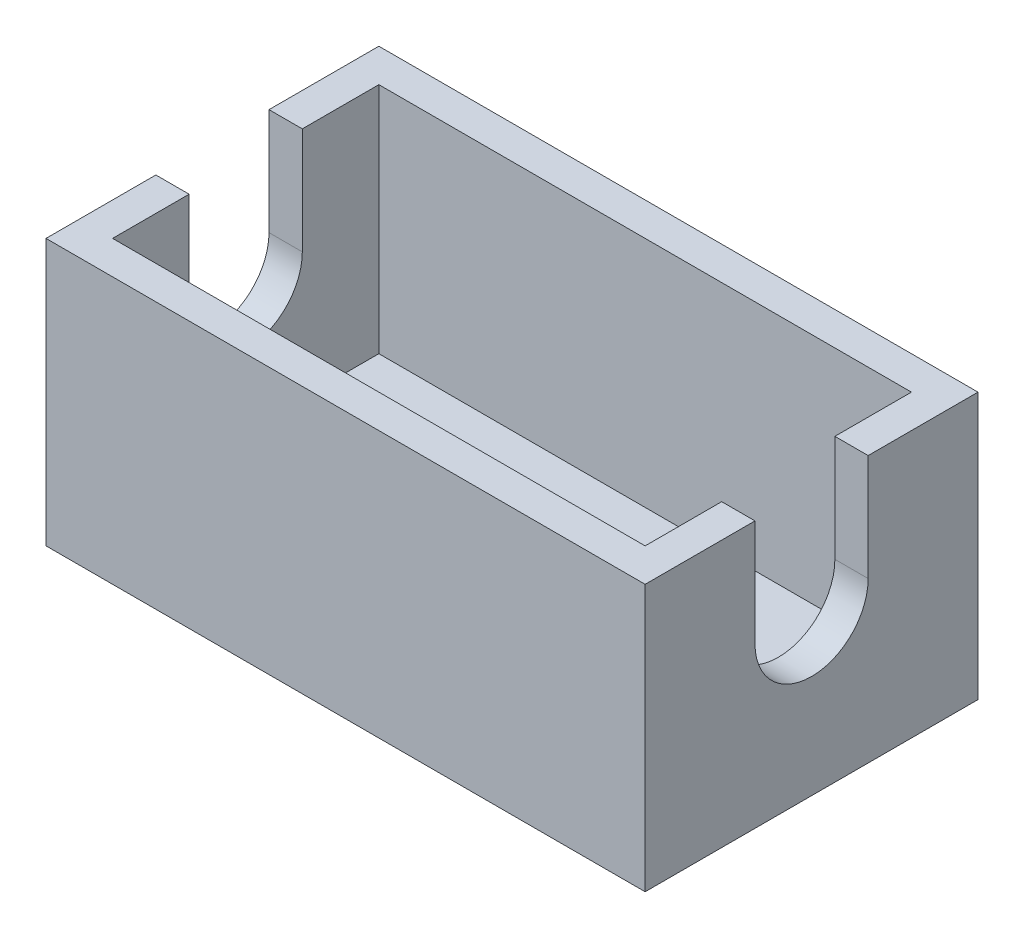
ISO-10303-21;
HEADER;
FILE_DESCRIPTION(('STEP AP214'),'2;1');
FILE_NAME('part.step','',(''),(''),'','','');
FILE_SCHEMA(('AUTOMOTIVE_DESIGN { 1 0 10303 214 1 1 1 1 }'));
ENDSEC;
DATA;
#1=APPLICATION_CONTEXT('core data for automotive mechanical design processes');
#2=APPLICATION_PROTOCOL_DEFINITION('international standard','automotive_design',2000,#1);
#3=PRODUCT_CONTEXT('',#1,'mechanical');
#4=PRODUCT('Part','Part','',(#3));
#5=PRODUCT_RELATED_PRODUCT_CATEGORY('part','',(#4));
#6=PRODUCT_DEFINITION_FORMATION('','',#4);
#7=PRODUCT_DEFINITION_CONTEXT('part definition',#1,'design');
#8=PRODUCT_DEFINITION('design','',#6,#7);
#9=PRODUCT_DEFINITION_SHAPE('','',#8);
#10=(LENGTH_UNIT() NAMED_UNIT(*) SI_UNIT(.MILLI.,.METRE.));
#11=(NAMED_UNIT(*) PLANE_ANGLE_UNIT() SI_UNIT($,.RADIAN.));
#12=(NAMED_UNIT(*) SI_UNIT($,.STERADIAN.) SOLID_ANGLE_UNIT());
#13=UNCERTAINTY_MEASURE_WITH_UNIT(LENGTH_MEASURE(1.E-05),#10,'distance_accuracy_value','');
#14=(GEOMETRIC_REPRESENTATION_CONTEXT(3) GLOBAL_UNCERTAINTY_ASSIGNED_CONTEXT((#13)) GLOBAL_UNIT_ASSIGNED_CONTEXT((#10,
#11,#12)) REPRESENTATION_CONTEXT('',''));
#15=CARTESIAN_POINT('',(0.,0.,0.));
#16=DIRECTION('',(0.,0.,1.));
#17=DIRECTION('',(1.,0.,0.));
#18=AXIS2_PLACEMENT_3D('',#15,#16,#17);
#19=CARTESIAN_POINT('',(0.,20.,0.));
#20=DIRECTION('',(0.,1.,0.));
#21=DIRECTION('',(0.,0.,1.));
#22=AXIS2_PLACEMENT_3D('',#19,#20,#21);
#23=PLANE('',#22);
#24=DIRECTION('',(1.,0.,0.));
#25=VECTOR('',#24,1.);
#26=CARTESIAN_POINT('',(-22.5,20.,4.25));
#27=LINE('',#26,#25);
#28=CARTESIAN_POINT('',(-22.5,20.,4.25));
#29=VERTEX_POINT('',#28);
#30=CARTESIAN_POINT('',(-20.,20.,4.25));
#31=VERTEX_POINT('',#30);
#32=EDGE_CURVE('E180',#29,#31,#27,.T.);
#33=ORIENTED_EDGE('',*,*,#32,.F.);
#34=DIRECTION('',(0.,0.,1.));
#35=VECTOR('',#34,1.);
#36=CARTESIAN_POINT('',(-22.5,20.,12.5));
#37=LINE('',#36,#35);
#38=CARTESIAN_POINT('',(-22.5,20.,12.5));
#39=VERTEX_POINT('',#38);
#40=EDGE_CURVE('E220',#29,#39,#37,.T.);
#41=ORIENTED_EDGE('',*,*,#40,.T.);
#42=DIRECTION('',(1.,0.,0.));
#43=VECTOR('',#42,1.);
#44=CARTESIAN_POINT('',(22.5,20.,12.5));
#45=LINE('',#44,#43);
#46=CARTESIAN_POINT('',(22.5,20.,12.5));
#47=VERTEX_POINT('',#46);
#48=EDGE_CURVE('E223',#39,#47,#45,.T.);
#49=ORIENTED_EDGE('',*,*,#48,.T.);
#50=DIRECTION('',(0.,0.,-1.));
#51=VECTOR('',#50,1.);
#52=CARTESIAN_POINT('',(22.5,20.,12.5));
#53=LINE('',#52,#51);
#54=CARTESIAN_POINT('',(22.5,20.,4.25));
#55=VERTEX_POINT('',#54);
#56=EDGE_CURVE('E227',#47,#55,#53,.T.);
#57=ORIENTED_EDGE('',*,*,#56,.T.);
#58=CARTESIAN_POINT('',(20.,20.,4.25));
#59=VERTEX_POINT('',#58);
#60=EDGE_CURVE('E182',#59,#55,#27,.T.);
#61=ORIENTED_EDGE('',*,*,#60,.F.);
#62=DIRECTION('',(0.,0.,-1.));
#63=VECTOR('',#62,1.);
#64=CARTESIAN_POINT('',(20.,20.,10.));
#65=LINE('',#64,#63);
#66=CARTESIAN_POINT('',(20.,20.,10.));
#67=VERTEX_POINT('',#66);
#68=EDGE_CURVE('E196',#67,#59,#65,.T.);
#69=ORIENTED_EDGE('',*,*,#68,.F.);
#70=DIRECTION('',(1.,0.,0.));
#71=VECTOR('',#70,1.);
#72=CARTESIAN_POINT('',(20.,20.,10.));
#73=LINE('',#72,#71);
#74=CARTESIAN_POINT('',(-20.,20.,10.));
#75=VERTEX_POINT('',#74);
#76=EDGE_CURVE('E192',#75,#67,#73,.T.);
#77=ORIENTED_EDGE('',*,*,#76,.F.);
#78=DIRECTION('',(0.,0.,1.));
#79=VECTOR('',#78,1.);
#80=CARTESIAN_POINT('',(-20.,20.,10.));
#81=LINE('',#80,#79);
#82=EDGE_CURVE('E193',#31,#75,#81,.T.);
#83=ORIENTED_EDGE('',*,*,#82,.F.);
#84=EDGE_LOOP('',(#33,#41,#49,#57,#61,#69,#77,#83));
#85=FACE_BOUND('',#84,.T.);
#86=ADVANCED_FACE('F33',(#85),#23,.T.);
#87=CARTESIAN_POINT('',(-22.5,2.5,12.5));
#88=DIRECTION('',(1.,0.,0.));
#89=DIRECTION('',(0.,0.,-1.));
#90=AXIS2_PLACEMENT_3D('',#87,#88,#89);
#91=PLANE('',#90);
#92=ORIENTED_EDGE('',*,*,#40,.F.);
#93=DIRECTION('',(0.,-1.,0.));
#94=VECTOR('',#93,1.);
#95=CARTESIAN_POINT('',(-22.5,12.,4.25));
#96=LINE('',#95,#94);
#97=CARTESIAN_POINT('',(-22.5,12.,4.25));
#98=VERTEX_POINT('',#97);
#99=EDGE_CURVE('E162',#29,#98,#96,.T.);
#100=ORIENTED_EDGE('',*,*,#99,.T.);
#101=CARTESIAN_POINT('',(-22.5,12.,0.));
#102=DIRECTION('',(1.,0.,0.));
#103=DIRECTION('',(0.,0.,-1.));
#104=AXIS2_PLACEMENT_3D('',#101,#102,#103);
#105=CIRCLE('',#104,4.25);
#106=CARTESIAN_POINT('',(-22.5,12.,-4.25));
#107=VERTEX_POINT('',#106);
#108=EDGE_CURVE('E147',#98,#107,#105,.T.);
#109=ORIENTED_EDGE('',*,*,#108,.T.);
#110=DIRECTION('',(0.,1.,0.));
#111=VECTOR('',#110,1.);
#112=CARTESIAN_POINT('',(-22.5,20.,-4.25));
#113=LINE('',#112,#111);
#114=CARTESIAN_POINT('',(-22.5,20.,-4.25));
#115=VERTEX_POINT('',#114);
#116=EDGE_CURVE('E155',#107,#115,#113,.T.);
#117=ORIENTED_EDGE('',*,*,#116,.T.);
#118=CARTESIAN_POINT('',(-22.5,20.,-12.5));
#119=VERTEX_POINT('',#118);
#120=EDGE_CURVE('E221',#119,#115,#37,.T.);
#121=ORIENTED_EDGE('',*,*,#120,.F.);
#122=DIRECTION('',(0.,-1.,0.));
#123=VECTOR('',#122,1.);
#124=CARTESIAN_POINT('',(-22.5,2.5,-12.5));
#125=LINE('',#124,#123);
#126=CARTESIAN_POINT('',(-22.5,0.,-12.5));
#127=VERTEX_POINT('',#126);
#128=EDGE_CURVE('E242',#119,#127,#125,.T.);
#129=ORIENTED_EDGE('',*,*,#128,.T.);
#130=DIRECTION('',(0.,0.,1.));
#131=VECTOR('',#130,1.);
#132=CARTESIAN_POINT('',(-22.5,0.,12.5));
#133=LINE('',#132,#131);
#134=CARTESIAN_POINT('',(-22.5,0.,12.5));
#135=VERTEX_POINT('',#134);
#136=EDGE_CURVE('E233',#127,#135,#133,.T.);
#137=ORIENTED_EDGE('',*,*,#136,.T.);
#138=DIRECTION('',(0.,-1.,0.));
#139=VECTOR('',#138,1.);
#140=CARTESIAN_POINT('',(-22.5,2.5,12.5));
#141=LINE('',#140,#139);
#142=EDGE_CURVE('E251',#39,#135,#141,.T.);
#143=ORIENTED_EDGE('',*,*,#142,.F.);
#144=EDGE_LOOP('',(#92,#100,#109,#117,#121,#129,#137,#143));
#145=FACE_BOUND('',#144,.T.);
#146=ADVANCED_FACE('F35',(#145),#91,.F.);
#147=CARTESIAN_POINT('',(22.5,2.5,12.5));
#148=DIRECTION('',(0.,0.,-1.));
#149=DIRECTION('',(-1.,0.,0.));
#150=AXIS2_PLACEMENT_3D('',#147,#148,#149);
#151=PLANE('',#150);
#152=DIRECTION('',(1.,0.,0.));
#153=VECTOR('',#152,1.);
#154=CARTESIAN_POINT('',(22.5,0.,12.5));
#155=LINE('',#154,#153);
#156=CARTESIAN_POINT('',(22.5,0.,12.5));
#157=VERTEX_POINT('',#156);
#158=EDGE_CURVE('E236',#135,#157,#155,.T.);
#159=ORIENTED_EDGE('',*,*,#158,.T.);
#160=DIRECTION('',(0.,-1.,0.));
#161=VECTOR('',#160,1.);
#162=CARTESIAN_POINT('',(22.5,2.5,12.5));
#163=LINE('',#162,#161);
#164=EDGE_CURVE('E248',#47,#157,#163,.T.);
#165=ORIENTED_EDGE('',*,*,#164,.F.);
#166=ORIENTED_EDGE('',*,*,#48,.F.);
#167=ORIENTED_EDGE('',*,*,#142,.T.);
#168=EDGE_LOOP('',(#159,#165,#166,#167));
#169=FACE_BOUND('',#168,.T.);
#170=ADVANCED_FACE('F315',(#169),#151,.F.);
#171=CARTESIAN_POINT('',(22.5,2.5,12.5));
#172=DIRECTION('',(-1.,0.,0.));
#173=DIRECTION('',(0.,0.,1.));
#174=AXIS2_PLACEMENT_3D('',#171,#172,#173);
#175=PLANE('',#174);
#176=CARTESIAN_POINT('',(22.5,12.,0.));
#177=DIRECTION('',(1.,0.,0.));
#178=DIRECTION('',(0.,0.,-1.));
#179=AXIS2_PLACEMENT_3D('',#176,#177,#178);
#180=CIRCLE('',#179,4.25);
#181=CARTESIAN_POINT('',(22.5,12.,4.25));
#182=VERTEX_POINT('',#181);
#183=CARTESIAN_POINT('',(22.5,12.,-4.25));
#184=VERTEX_POINT('',#183);
#185=EDGE_CURVE('E172',#182,#184,#180,.T.);
#186=ORIENTED_EDGE('',*,*,#185,.F.);
#187=DIRECTION('',(0.,-1.,0.));
#188=VECTOR('',#187,1.);
#189=CARTESIAN_POINT('',(22.5,12.,4.25));
#190=LINE('',#189,#188);
#191=EDGE_CURVE('E165',#55,#182,#190,.T.);
#192=ORIENTED_EDGE('',*,*,#191,.F.);
#193=ORIENTED_EDGE('',*,*,#56,.F.);
#194=ORIENTED_EDGE('',*,*,#164,.T.);
#195=DIRECTION('',(0.,0.,-1.));
#196=VECTOR('',#195,1.);
#197=CARTESIAN_POINT('',(22.5,0.,12.5));
#198=LINE('',#197,#196);
#199=CARTESIAN_POINT('',(22.5,0.,-12.5));
#200=VERTEX_POINT('',#199);
#201=EDGE_CURVE('E238',#157,#200,#198,.T.);
#202=ORIENTED_EDGE('',*,*,#201,.T.);
#203=DIRECTION('',(0.,-1.,0.));
#204=VECTOR('',#203,1.);
#205=CARTESIAN_POINT('',(22.5,2.5,-12.5));
#206=LINE('',#205,#204);
#207=CARTESIAN_POINT('',(22.5,20.,-12.5));
#208=VERTEX_POINT('',#207);
#209=EDGE_CURVE('E245',#208,#200,#206,.T.);
#210=ORIENTED_EDGE('',*,*,#209,.F.);
#211=CARTESIAN_POINT('',(22.5,20.,-4.25));
#212=VERTEX_POINT('',#211);
#213=EDGE_CURVE('E226',#212,#208,#53,.T.);
#214=ORIENTED_EDGE('',*,*,#213,.F.);
#215=DIRECTION('',(0.,1.,0.));
#216=VECTOR('',#215,1.);
#217=CARTESIAN_POINT('',(22.5,20.,-4.25));
#218=LINE('',#217,#216);
#219=EDGE_CURVE('E168',#184,#212,#218,.T.);
#220=ORIENTED_EDGE('',*,*,#219,.F.);
#221=EDGE_LOOP('',(#186,#192,#193,#194,#202,#210,#214,#220));
#222=FACE_BOUND('',#221,.T.);
#223=ADVANCED_FACE('F277',(#222),#175,.F.);
#224=CARTESIAN_POINT('',(22.5,2.5,-12.5));
#225=DIRECTION('',(0.,0.,1.));
#226=DIRECTION('',(1.,0.,0.));
#227=AXIS2_PLACEMENT_3D('',#224,#225,#226);
#228=PLANE('',#227);
#229=DIRECTION('',(-1.,0.,0.));
#230=VECTOR('',#229,1.);
#231=CARTESIAN_POINT('',(22.5,0.,-12.5));
#232=LINE('',#231,#230);
#233=EDGE_CURVE('E240',#200,#127,#232,.T.);
#234=ORIENTED_EDGE('',*,*,#233,.T.);
#235=ORIENTED_EDGE('',*,*,#128,.F.);
#236=DIRECTION('',(-1.,0.,0.));
#237=VECTOR('',#236,1.);
#238=CARTESIAN_POINT('',(22.5,20.,-12.5));
#239=LINE('',#238,#237);
#240=EDGE_CURVE('E230',#208,#119,#239,.T.);
#241=ORIENTED_EDGE('',*,*,#240,.F.);
#242=ORIENTED_EDGE('',*,*,#209,.T.);
#243=EDGE_LOOP('',(#234,#235,#241,#242));
#244=FACE_BOUND('',#243,.T.);
#245=ADVANCED_FACE('F322',(#244),#228,.F.);
#246=CARTESIAN_POINT('',(0.,0.,0.));
#247=DIRECTION('',(0.,1.,0.));
#248=DIRECTION('',(0.,0.,1.));
#249=AXIS2_PLACEMENT_3D('',#246,#247,#248);
#250=PLANE('',#249);
#251=ORIENTED_EDGE('',*,*,#136,.F.);
#252=ORIENTED_EDGE('',*,*,#233,.F.);
#253=ORIENTED_EDGE('',*,*,#201,.F.);
#254=ORIENTED_EDGE('',*,*,#158,.F.);
#255=EDGE_LOOP('',(#251,#252,#253,#254));
#256=FACE_BOUND('',#255,.T.);
#257=ADVANCED_FACE('F318',(#256),#250,.F.);
#258=DIRECTION('',(1.,0.,0.));
#259=VECTOR('',#258,1.);
#260=CARTESIAN_POINT('',(-22.5,20.,-4.25));
#261=LINE('',#260,#259);
#262=CARTESIAN_POINT('',(20.,20.,-4.25));
#263=VERTEX_POINT('',#262);
#264=EDGE_CURVE('E56',#263,#212,#261,.T.);
#265=ORIENTED_EDGE('',*,*,#264,.T.);
#266=ORIENTED_EDGE('',*,*,#213,.T.);
#267=ORIENTED_EDGE('',*,*,#240,.T.);
#268=ORIENTED_EDGE('',*,*,#120,.T.);
#269=CARTESIAN_POINT('',(-20.,20.,-4.25));
#270=VERTEX_POINT('',#269);
#271=EDGE_CURVE('E158',#115,#270,#261,.T.);
#272=ORIENTED_EDGE('',*,*,#271,.T.);
#273=CARTESIAN_POINT('',(-20.,20.,-10.));
#274=VERTEX_POINT('',#273);
#275=EDGE_CURVE('E189',#274,#270,#81,.T.);
#276=ORIENTED_EDGE('',*,*,#275,.F.);
#277=DIRECTION('',(-1.,0.,0.));
#278=VECTOR('',#277,1.);
#279=CARTESIAN_POINT('',(20.,20.,-10.));
#280=LINE('',#279,#278);
#281=CARTESIAN_POINT('',(20.,20.,-10.));
#282=VERTEX_POINT('',#281);
#283=EDGE_CURVE('E199',#282,#274,#280,.T.);
#284=ORIENTED_EDGE('',*,*,#283,.F.);
#285=EDGE_CURVE('E195',#263,#282,#65,.T.);
#286=ORIENTED_EDGE('',*,*,#285,.F.);
#287=EDGE_LOOP('',(#265,#266,#267,#268,#272,#276,#284,#286));
#288=FACE_BOUND('',#287,.T.);
#289=ADVANCED_FACE('F284',(#288),#23,.T.);
#290=CARTESIAN_POINT('',(-20.,20.,10.));
#291=DIRECTION('',(1.,0.,0.));
#292=DIRECTION('',(0.,0.,-1.));
#293=AXIS2_PLACEMENT_3D('',#290,#291,#292);
#294=PLANE('',#293);
#295=DIRECTION('',(0.,-1.,0.));
#296=VECTOR('',#295,1.);
#297=CARTESIAN_POINT('',(-20.,20.,4.25));
#298=LINE('',#297,#296);
#299=CARTESIAN_POINT('',(-20.,12.,4.25));
#300=VERTEX_POINT('',#299);
#301=EDGE_CURVE('E185',#31,#300,#298,.T.);
#302=ORIENTED_EDGE('',*,*,#301,.F.);
#303=ORIENTED_EDGE('',*,*,#82,.T.);
#304=DIRECTION('',(0.,-1.,0.));
#305=VECTOR('',#304,1.);
#306=CARTESIAN_POINT('',(-20.,20.,10.));
#307=LINE('',#306,#305);
#308=CARTESIAN_POINT('',(-20.,2.5,10.));
#309=VERTEX_POINT('',#308);
#310=EDGE_CURVE('E217',#75,#309,#307,.T.);
#311=ORIENTED_EDGE('',*,*,#310,.T.);
#312=DIRECTION('',(0.,0.,1.));
#313=VECTOR('',#312,1.);
#314=CARTESIAN_POINT('',(-20.,2.5,10.));
#315=LINE('',#314,#313);
#316=CARTESIAN_POINT('',(-20.,2.5,-10.));
#317=VERTEX_POINT('',#316);
#318=EDGE_CURVE('E188',#317,#309,#315,.T.);
#319=ORIENTED_EDGE('',*,*,#318,.F.);
#320=DIRECTION('',(0.,-1.,0.));
#321=VECTOR('',#320,1.);
#322=CARTESIAN_POINT('',(-20.,20.,-10.));
#323=LINE('',#322,#321);
#324=EDGE_CURVE('E201',#274,#317,#323,.T.);
#325=ORIENTED_EDGE('',*,*,#324,.F.);
#326=ORIENTED_EDGE('',*,*,#275,.T.);
#327=DIRECTION('',(0.,1.,0.));
#328=VECTOR('',#327,1.);
#329=CARTESIAN_POINT('',(-20.,20.,-4.25));
#330=LINE('',#329,#328);
#331=CARTESIAN_POINT('',(-20.,12.,-4.25));
#332=VERTEX_POINT('',#331);
#333=EDGE_CURVE('E178',#332,#270,#330,.T.);
#334=ORIENTED_EDGE('',*,*,#333,.F.);
#335=CARTESIAN_POINT('',(-20.,12.,0.));
#336=DIRECTION('',(1.,0.,0.));
#337=DIRECTION('',(0.,0.,-1.));
#338=AXIS2_PLACEMENT_3D('',#335,#336,#337);
#339=CIRCLE('',#338,4.25);
#340=EDGE_CURVE('E150',#300,#332,#339,.T.);
#341=ORIENTED_EDGE('',*,*,#340,.F.);
#342=EDGE_LOOP('',(#302,#303,#311,#319,#325,#326,#334,#341));
#343=FACE_BOUND('',#342,.T.);
#344=ADVANCED_FACE('F298',(#343),#294,.T.);
#345=CARTESIAN_POINT('',(20.,20.,10.));
#346=DIRECTION('',(0.,0.,-1.));
#347=DIRECTION('',(-1.,0.,0.));
#348=AXIS2_PLACEMENT_3D('',#345,#346,#347);
#349=PLANE('',#348);
#350=DIRECTION('',(1.,0.,0.));
#351=VECTOR('',#350,1.);
#352=CARTESIAN_POINT('',(20.,2.5,10.));
#353=LINE('',#352,#351);
#354=CARTESIAN_POINT('',(20.,2.5,10.));
#355=VERTEX_POINT('',#354);
#356=EDGE_CURVE('E203',#309,#355,#353,.T.);
#357=ORIENTED_EDGE('',*,*,#356,.F.);
#358=ORIENTED_EDGE('',*,*,#310,.F.);
#359=ORIENTED_EDGE('',*,*,#76,.T.);
#360=DIRECTION('',(0.,-1.,0.));
#361=VECTOR('',#360,1.);
#362=CARTESIAN_POINT('',(20.,20.,10.));
#363=LINE('',#362,#361);
#364=EDGE_CURVE('E214',#67,#355,#363,.T.);
#365=ORIENTED_EDGE('',*,*,#364,.T.);
#366=EDGE_LOOP('',(#357,#358,#359,#365));
#367=FACE_BOUND('',#366,.T.);
#368=ADVANCED_FACE('F301',(#367),#349,.T.);
#369=CARTESIAN_POINT('',(20.,20.,10.));
#370=DIRECTION('',(-1.,0.,0.));
#371=DIRECTION('',(0.,0.,1.));
#372=AXIS2_PLACEMENT_3D('',#369,#370,#371);
#373=PLANE('',#372);
#374=DIRECTION('',(0.,1.,0.));
#375=VECTOR('',#374,1.);
#376=CARTESIAN_POINT('',(20.,20.,4.25));
#377=LINE('',#376,#375);
#378=CARTESIAN_POINT('',(20.,12.,4.25));
#379=VERTEX_POINT('',#378);
#380=EDGE_CURVE('E11',#379,#59,#377,.T.);
#381=ORIENTED_EDGE('',*,*,#380,.F.);
#382=CARTESIAN_POINT('',(20.,12.,0.));
#383=DIRECTION('',(-1.,0.,0.));
#384=DIRECTION('',(0.,0.,1.));
#385=AXIS2_PLACEMENT_3D('',#382,#383,#384);
#386=CIRCLE('',#385,4.25);
#387=CARTESIAN_POINT('',(20.,12.,-4.25));
#388=VERTEX_POINT('',#387);
#389=EDGE_CURVE('E41',#388,#379,#386,.T.);
#390=ORIENTED_EDGE('',*,*,#389,.F.);
#391=DIRECTION('',(0.,-1.,0.));
#392=VECTOR('',#391,1.);
#393=CARTESIAN_POINT('',(20.,20.,-4.25));
#394=LINE('',#393,#392);
#395=EDGE_CURVE('E254',#263,#388,#394,.T.);
#396=ORIENTED_EDGE('',*,*,#395,.F.);
#397=ORIENTED_EDGE('',*,*,#285,.T.);
#398=DIRECTION('',(0.,-1.,0.));
#399=VECTOR('',#398,1.);
#400=CARTESIAN_POINT('',(20.,20.,-10.));
#401=LINE('',#400,#399);
#402=CARTESIAN_POINT('',(20.,2.5,-10.));
#403=VERTEX_POINT('',#402);
#404=EDGE_CURVE('E211',#282,#403,#401,.T.);
#405=ORIENTED_EDGE('',*,*,#404,.T.);
#406=DIRECTION('',(0.,0.,-1.));
#407=VECTOR('',#406,1.);
#408=CARTESIAN_POINT('',(20.,2.5,10.));
#409=LINE('',#408,#407);
#410=EDGE_CURVE('E205',#355,#403,#409,.T.);
#411=ORIENTED_EDGE('',*,*,#410,.F.);
#412=ORIENTED_EDGE('',*,*,#364,.F.);
#413=ORIENTED_EDGE('',*,*,#68,.T.);
#414=EDGE_LOOP('',(#381,#390,#396,#397,#405,#411,#412,#413));
#415=FACE_BOUND('',#414,.T.);
#416=ADVANCED_FACE('F267',(#415),#373,.T.);
#417=CARTESIAN_POINT('',(20.,20.,-10.));
#418=DIRECTION('',(0.,0.,1.));
#419=DIRECTION('',(1.,0.,0.));
#420=AXIS2_PLACEMENT_3D('',#417,#418,#419);
#421=PLANE('',#420);
#422=DIRECTION('',(-1.,0.,0.));
#423=VECTOR('',#422,1.);
#424=CARTESIAN_POINT('',(20.,2.5,-10.));
#425=LINE('',#424,#423);
#426=EDGE_CURVE('E207',#403,#317,#425,.T.);
#427=ORIENTED_EDGE('',*,*,#426,.F.);
#428=ORIENTED_EDGE('',*,*,#404,.F.);
#429=ORIENTED_EDGE('',*,*,#283,.T.);
#430=ORIENTED_EDGE('',*,*,#324,.T.);
#431=EDGE_LOOP('',(#427,#428,#429,#430));
#432=FACE_BOUND('',#431,.T.);
#433=ADVANCED_FACE('F290',(#432),#421,.T.);
#434=CARTESIAN_POINT('',(0.,2.5,0.));
#435=DIRECTION('',(0.,1.,0.));
#436=DIRECTION('',(0.,0.,1.));
#437=AXIS2_PLACEMENT_3D('',#434,#435,#436);
#438=PLANE('',#437);
#439=ORIENTED_EDGE('',*,*,#318,.T.);
#440=ORIENTED_EDGE('',*,*,#356,.T.);
#441=ORIENTED_EDGE('',*,*,#410,.T.);
#442=ORIENTED_EDGE('',*,*,#426,.T.);
#443=EDGE_LOOP('',(#439,#440,#441,#442));
#444=FACE_BOUND('',#443,.T.);
#445=ADVANCED_FACE('F294',(#444),#438,.T.);
#446=CARTESIAN_POINT('',(-22.5,12.,4.25));
#447=DIRECTION('',(0.,0.,1.));
#448=DIRECTION('',(1.,0.,0.));
#449=AXIS2_PLACEMENT_3D('',#446,#447,#448);
#450=PLANE('',#449);
#451=ORIENTED_EDGE('',*,*,#380,.T.);
#452=ORIENTED_EDGE('',*,*,#60,.T.);
#453=ORIENTED_EDGE('',*,*,#191,.T.);
#454=DIRECTION('',(1.,0.,0.));
#455=VECTOR('',#454,1.);
#456=CARTESIAN_POINT('',(-22.5,12.,4.25));
#457=LINE('',#456,#455);
#458=EDGE_CURVE('E179',#379,#182,#457,.T.);
#459=ORIENTED_EDGE('',*,*,#458,.F.);
#460=EDGE_LOOP('',(#451,#452,#453,#459));
#461=FACE_BOUND('',#460,.T.);
#462=ADVANCED_FACE('F263',(#461),#450,.F.);
#463=CARTESIAN_POINT('',(-22.5,20.,-4.25));
#464=DIRECTION('',(0.,0.,-1.));
#465=DIRECTION('',(0.,1.,0.));
#466=AXIS2_PLACEMENT_3D('',#463,#464,#465);
#467=PLANE('',#466);
#468=ORIENTED_EDGE('',*,*,#395,.T.);
#469=DIRECTION('',(1.,0.,0.));
#470=VECTOR('',#469,1.);
#471=CARTESIAN_POINT('',(-22.5,12.,-4.25));
#472=LINE('',#471,#470);
#473=EDGE_CURVE('E152',#388,#184,#472,.T.);
#474=ORIENTED_EDGE('',*,*,#473,.T.);
#475=ORIENTED_EDGE('',*,*,#219,.T.);
#476=ORIENTED_EDGE('',*,*,#264,.F.);
#477=EDGE_LOOP('',(#468,#474,#475,#476));
#478=FACE_BOUND('',#477,.T.);
#479=ADVANCED_FACE('F281',(#478),#467,.F.);
#480=CARTESIAN_POINT('',(-22.5,12.,0.));
#481=DIRECTION('',(1.,0.,0.));
#482=DIRECTION('',(0.,0.,-1.));
#483=AXIS2_PLACEMENT_3D('',#480,#481,#482);
#484=CYLINDRICAL_SURFACE('',#483,4.25);
#485=ORIENTED_EDGE('',*,*,#389,.T.);
#486=ORIENTED_EDGE('',*,*,#458,.T.);
#487=ORIENTED_EDGE('',*,*,#185,.T.);
#488=ORIENTED_EDGE('',*,*,#473,.F.);
#489=EDGE_LOOP('',(#485,#486,#487,#488));
#490=FACE_BOUND('',#489,.T.);
#491=ADVANCED_FACE('F259',(#490),#484,.F.);
#492=ORIENTED_EDGE('',*,*,#340,.T.);
#493=EDGE_CURVE('E48',#107,#332,#472,.T.);
#494=ORIENTED_EDGE('',*,*,#493,.F.);
#495=ORIENTED_EDGE('',*,*,#108,.F.);
#496=EDGE_CURVE('E176',#98,#300,#457,.T.);
#497=ORIENTED_EDGE('',*,*,#496,.T.);
#498=EDGE_LOOP('',(#492,#494,#495,#497));
#499=FACE_BOUND('',#498,.T.);
#500=ADVANCED_FACE('F144',(#499),#484,.F.);
#501=ORIENTED_EDGE('',*,*,#301,.T.);
#502=ORIENTED_EDGE('',*,*,#496,.F.);
#503=ORIENTED_EDGE('',*,*,#99,.F.);
#504=ORIENTED_EDGE('',*,*,#32,.T.);
#505=EDGE_LOOP('',(#501,#502,#503,#504));
#506=FACE_BOUND('',#505,.T.);
#507=ADVANCED_FACE('F343',(#506),#450,.F.);
#508=ORIENTED_EDGE('',*,*,#333,.T.);
#509=ORIENTED_EDGE('',*,*,#271,.F.);
#510=ORIENTED_EDGE('',*,*,#116,.F.);
#511=ORIENTED_EDGE('',*,*,#493,.T.);
#512=EDGE_LOOP('',(#508,#509,#510,#511));
#513=FACE_BOUND('',#512,.T.);
#514=ADVANCED_FACE('F156',(#513),#467,.F.);
#515=CLOSED_SHELL('',(#86,#146,#170,#223,#245,#257,#289,#344,#368,#416,#433,#445,#462,#479,#491,
#500,#507,#514));
#516=MANIFOLD_SOLID_BREP('B2',#515);
#517=ADVANCED_BREP_SHAPE_REPRESENTATION('',(#18,#516),#14);
#518=SHAPE_DEFINITION_REPRESENTATION(#9,#517);
ENDSEC;
END-ISO-10303-21;
